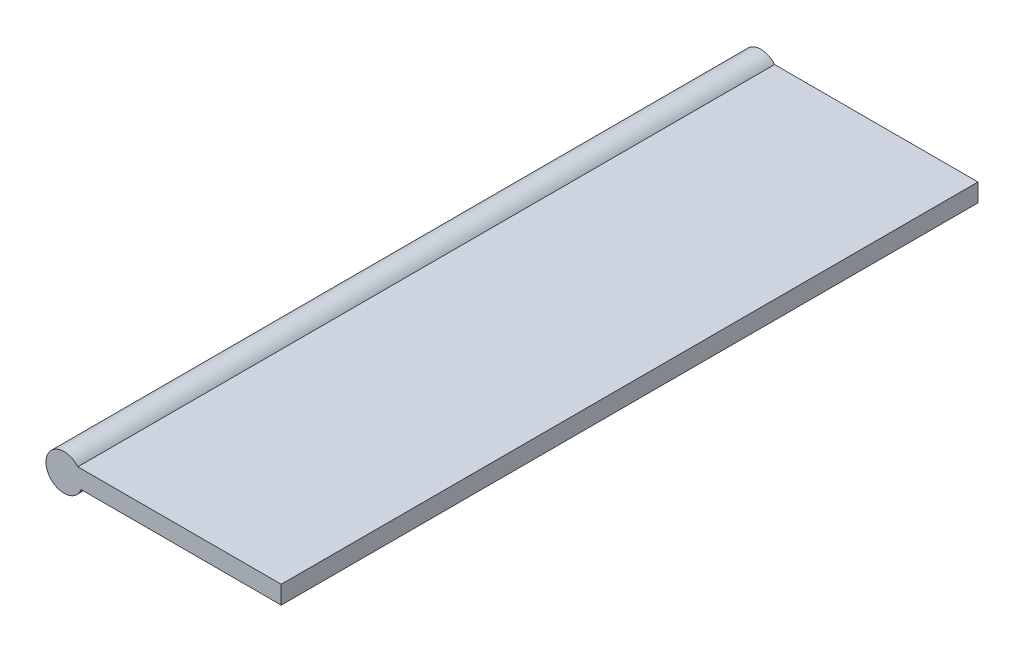
ISO-10303-21;
HEADER;
FILE_DESCRIPTION(('STEP AP214'),'2;1');
FILE_NAME('part.step','',(''),(''),'','','');
FILE_SCHEMA(('AUTOMOTIVE_DESIGN { 1 0 10303 214 1 1 1 1 }'));
ENDSEC;
DATA;
#1=APPLICATION_CONTEXT('core data for automotive mechanical design processes');
#2=APPLICATION_PROTOCOL_DEFINITION('international standard','automotive_design',2000,#1);
#3=PRODUCT_CONTEXT('',#1,'mechanical');
#4=PRODUCT('Part','Part','',(#3));
#5=PRODUCT_RELATED_PRODUCT_CATEGORY('part','',(#4));
#6=PRODUCT_DEFINITION_FORMATION('','',#4);
#7=PRODUCT_DEFINITION_CONTEXT('part definition',#1,'design');
#8=PRODUCT_DEFINITION('design','',#6,#7);
#9=PRODUCT_DEFINITION_SHAPE('','',#8);
#10=(LENGTH_UNIT() NAMED_UNIT(*) SI_UNIT(.MILLI.,.METRE.));
#11=(NAMED_UNIT(*) PLANE_ANGLE_UNIT() SI_UNIT($,.RADIAN.));
#12=(NAMED_UNIT(*) SI_UNIT($,.STERADIAN.) SOLID_ANGLE_UNIT());
#13=UNCERTAINTY_MEASURE_WITH_UNIT(LENGTH_MEASURE(1.E-05),#10,'distance_accuracy_value','');
#14=(GEOMETRIC_REPRESENTATION_CONTEXT(3) GLOBAL_UNCERTAINTY_ASSIGNED_CONTEXT((#13)) GLOBAL_UNIT_ASSIGNED_CONTEXT((#10,
#11,#12)) REPRESENTATION_CONTEXT('',''));
#15=CARTESIAN_POINT('',(0.,0.,0.));
#16=DIRECTION('',(0.,0.,1.));
#17=DIRECTION('',(1.,0.,0.));
#18=AXIS2_PLACEMENT_3D('',#15,#16,#17);
#19=CARTESIAN_POINT('',(0.,0.,97.79));
#20=DIRECTION('',(0.,0.,-1.));
#21=DIRECTION('',(-1.,0.,0.));
#22=AXIS2_PLACEMENT_3D('',#19,#20,#21);
#23=CYLINDRICAL_SURFACE('',#22,2.54);
#24=DIRECTION('',(0.,0.,-1.));
#25=VECTOR('',#24,1.);
#26=CARTESIAN_POINT('',(2.3790402426002,-0.889813196175905,97.79));
#27=LINE('',#26,#25);
#28=CARTESIAN_POINT('',(2.3790402426002,-0.889813196175905,97.79));
#29=VERTEX_POINT('',#28);
#30=CARTESIAN_POINT('',(2.3790402426002,-0.889813196175905,0.));
#31=VERTEX_POINT('',#30);
#32=EDGE_CURVE('E58',#29,#31,#27,.T.);
#33=ORIENTED_EDGE('',*,*,#32,.F.);
#34=CARTESIAN_POINT('',(0.,0.,97.79));
#35=DIRECTION('',(0.,0.,1.));
#36=DIRECTION('',(1.,0.,0.));
#37=AXIS2_PLACEMENT_3D('',#34,#35,#36);
#38=CIRCLE('',#37,2.54);
#39=CARTESIAN_POINT('',(1.93092814793426,1.65018680382409,97.79));
#40=VERTEX_POINT('',#39);
#41=EDGE_CURVE('E11',#40,#29,#38,.T.);
#42=ORIENTED_EDGE('',*,*,#41,.F.);
#43=DIRECTION('',(0.,0.,-1.));
#44=VECTOR('',#43,1.);
#45=CARTESIAN_POINT('',(1.93092814793426,1.65018680382409,97.79));
#46=LINE('',#45,#44);
#47=CARTESIAN_POINT('',(1.93092814793426,1.65018680382409,0.));
#48=VERTEX_POINT('',#47);
#49=EDGE_CURVE('E104',#48,#40,#46,.F.);
#50=ORIENTED_EDGE('',*,*,#49,.F.);
#51=CARTESIAN_POINT('',(0.,0.,0.));
#52=DIRECTION('',(0.,0.,1.));
#53=DIRECTION('',(1.,0.,0.));
#54=AXIS2_PLACEMENT_3D('',#51,#52,#53);
#55=CIRCLE('',#54,2.54);
#56=EDGE_CURVE('E46',#48,#31,#55,.T.);
#57=ORIENTED_EDGE('',*,*,#56,.T.);
#58=EDGE_LOOP('',(#33,#42,#50,#57));
#59=FACE_BOUND('',#58,.T.);
#60=ADVANCED_FACE('F43',(#59),#23,.T.);
#61=CARTESIAN_POINT('',(0.,0.,97.79));
#62=DIRECTION('',(0.,0.,1.));
#63=DIRECTION('',(1.,0.,0.));
#64=AXIS2_PLACEMENT_3D('',#61,#62,#63);
#65=PLANE('',#64);
#66=ORIENTED_EDGE('',*,*,#41,.T.);
#67=DIRECTION('',(-1.,0.,0.));
#68=VECTOR('',#67,1.);
#69=CARTESIAN_POINT('',(30.48,-0.889813196175905,97.79));
#70=LINE('',#69,#68);
#71=CARTESIAN_POINT('',(30.48,-0.889813196175905,97.79));
#72=VERTEX_POINT('',#71);
#73=EDGE_CURVE('E84',#72,#29,#70,.T.);
#74=ORIENTED_EDGE('',*,*,#73,.F.);
#75=DIRECTION('',(0.,-1.,0.));
#76=VECTOR('',#75,1.);
#77=CARTESIAN_POINT('',(30.48,1.65018680382409,97.79));
#78=LINE('',#77,#76);
#79=CARTESIAN_POINT('',(30.48,1.65018680382409,97.79));
#80=VERTEX_POINT('',#79);
#81=EDGE_CURVE('E91',#80,#72,#78,.T.);
#82=ORIENTED_EDGE('',*,*,#81,.F.);
#83=DIRECTION('',(-1.,0.,0.));
#84=VECTOR('',#83,1.);
#85=CARTESIAN_POINT('',(30.48,1.65018680382409,97.79));
#86=LINE('',#85,#84);
#87=EDGE_CURVE('E123',#80,#40,#86,.T.);
#88=ORIENTED_EDGE('',*,*,#87,.T.);
#89=EDGE_LOOP('',(#66,#74,#82,#88));
#90=FACE_BOUND('',#89,.T.);
#91=ADVANCED_FACE('F102',(#90),#65,.T.);
#92=CARTESIAN_POINT('',(0.,0.,0.));
#93=DIRECTION('',(0.,0.,1.));
#94=DIRECTION('',(1.,0.,0.));
#95=AXIS2_PLACEMENT_3D('',#92,#93,#94);
#96=PLANE('',#95);
#97=ORIENTED_EDGE('',*,*,#56,.F.);
#98=DIRECTION('',(-1.,0.,0.));
#99=VECTOR('',#98,1.);
#100=CARTESIAN_POINT('',(30.48,1.65018680382409,0.));
#101=LINE('',#100,#99);
#102=CARTESIAN_POINT('',(30.48,1.65018680382409,0.));
#103=VERTEX_POINT('',#102);
#104=EDGE_CURVE('E110',#103,#48,#101,.T.);
#105=ORIENTED_EDGE('',*,*,#104,.F.);
#106=DIRECTION('',(0.,1.,0.));
#107=VECTOR('',#106,1.);
#108=CARTESIAN_POINT('',(30.48,1.65018680382409,0.));
#109=LINE('',#108,#107);
#110=CARTESIAN_POINT('',(30.48,-0.889813196175905,0.));
#111=VERTEX_POINT('',#110);
#112=EDGE_CURVE('E90',#111,#103,#109,.T.);
#113=ORIENTED_EDGE('',*,*,#112,.F.);
#114=DIRECTION('',(-1.,0.,0.));
#115=VECTOR('',#114,1.);
#116=CARTESIAN_POINT('',(30.48,-0.889813196175905,0.));
#117=LINE('',#116,#115);
#118=EDGE_CURVE('E86',#111,#31,#117,.T.);
#119=ORIENTED_EDGE('',*,*,#118,.T.);
#120=EDGE_LOOP('',(#97,#105,#113,#119));
#121=FACE_BOUND('',#120,.T.);
#122=ADVANCED_FACE('F117',(#121),#96,.F.);
#123=CARTESIAN_POINT('',(30.48,-0.889813196175905,97.79));
#124=DIRECTION('',(0.,1.,0.));
#125=DIRECTION('',(0.,0.,1.));
#126=AXIS2_PLACEMENT_3D('',#123,#124,#125);
#127=PLANE('',#126);
#128=ORIENTED_EDGE('',*,*,#73,.T.);
#129=ORIENTED_EDGE('',*,*,#32,.T.);
#130=ORIENTED_EDGE('',*,*,#118,.F.);
#131=DIRECTION('',(0.,0.,-1.));
#132=VECTOR('',#131,1.);
#133=CARTESIAN_POINT('',(30.48,-0.889813196175905,97.79));
#134=LINE('',#133,#132);
#135=EDGE_CURVE('E80',#72,#111,#134,.T.);
#136=ORIENTED_EDGE('',*,*,#135,.F.);
#137=EDGE_LOOP('',(#128,#129,#130,#136));
#138=FACE_BOUND('',#137,.T.);
#139=ADVANCED_FACE('F82',(#138),#127,.F.);
#140=CARTESIAN_POINT('',(30.48,1.65018680382409,97.79));
#141=DIRECTION('',(0.,-1.,0.));
#142=DIRECTION('',(0.,0.,-1.));
#143=AXIS2_PLACEMENT_3D('',#140,#141,#142);
#144=PLANE('',#143);
#145=ORIENTED_EDGE('',*,*,#104,.T.);
#146=ORIENTED_EDGE('',*,*,#49,.T.);
#147=ORIENTED_EDGE('',*,*,#87,.F.);
#148=DIRECTION('',(0.,0.,1.));
#149=VECTOR('',#148,1.);
#150=CARTESIAN_POINT('',(30.48,1.65018680382409,97.79));
#151=LINE('',#150,#149);
#152=EDGE_CURVE('E96',#103,#80,#151,.T.);
#153=ORIENTED_EDGE('',*,*,#152,.F.);
#154=EDGE_LOOP('',(#145,#146,#147,#153));
#155=FACE_BOUND('',#154,.T.);
#156=ADVANCED_FACE('F129',(#155),#144,.F.);
#157=CARTESIAN_POINT('',(30.48,0.,0.));
#158=DIRECTION('',(1.,0.,0.));
#159=DIRECTION('',(0.,0.,-1.));
#160=AXIS2_PLACEMENT_3D('',#157,#158,#159);
#161=PLANE('',#160);
#162=ORIENTED_EDGE('',*,*,#81,.T.);
#163=ORIENTED_EDGE('',*,*,#135,.T.);
#164=ORIENTED_EDGE('',*,*,#112,.T.);
#165=ORIENTED_EDGE('',*,*,#152,.T.);
#166=EDGE_LOOP('',(#162,#163,#164,#165));
#167=FACE_BOUND('',#166,.T.);
#168=ADVANCED_FACE('F94',(#167),#161,.T.);
#169=CLOSED_SHELL('',(#60,#91,#122,#139,#156,#168));
#170=MANIFOLD_SOLID_BREP('B2',#169);
#171=ADVANCED_BREP_SHAPE_REPRESENTATION('',(#18,#170),#14);
#172=SHAPE_DEFINITION_REPRESENTATION(#9,#171);
ENDSEC;
END-ISO-10303-21;
